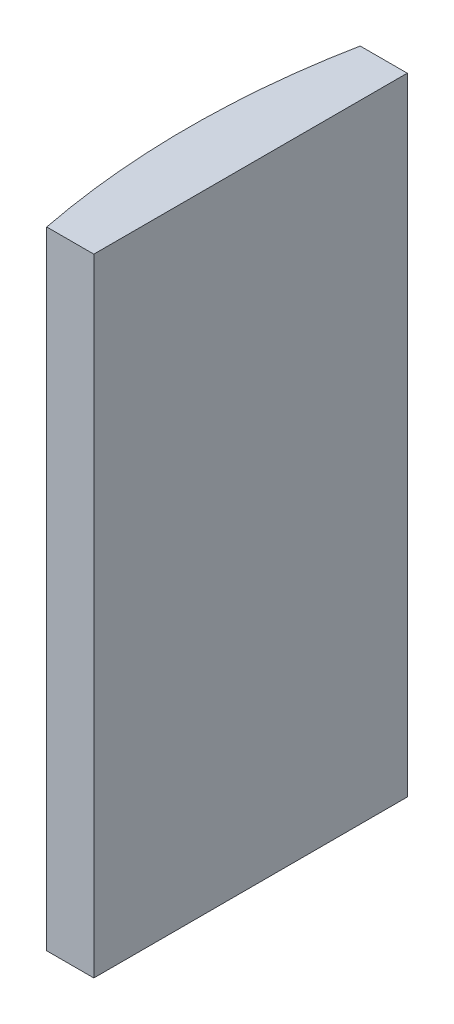
ISO-10303-21;
HEADER;
FILE_DESCRIPTION(('STEP AP214'),'2;1');
FILE_NAME('part.step','',(''),(''),'','','');
FILE_SCHEMA(('AUTOMOTIVE_DESIGN { 1 0 10303 214 1 1 1 1 }'));
ENDSEC;
DATA;
#1=APPLICATION_CONTEXT('core data for automotive mechanical design processes');
#2=APPLICATION_PROTOCOL_DEFINITION('international standard','automotive_design',2000,#1);
#3=PRODUCT_CONTEXT('',#1,'mechanical');
#4=PRODUCT('Part','Part','',(#3));
#5=PRODUCT_RELATED_PRODUCT_CATEGORY('part','',(#4));
#6=PRODUCT_DEFINITION_FORMATION('','',#4);
#7=PRODUCT_DEFINITION_CONTEXT('part definition',#1,'design');
#8=PRODUCT_DEFINITION('design','',#6,#7);
#9=PRODUCT_DEFINITION_SHAPE('','',#8);
#10=(LENGTH_UNIT() NAMED_UNIT(*) SI_UNIT(.MILLI.,.METRE.));
#11=(NAMED_UNIT(*) PLANE_ANGLE_UNIT() SI_UNIT($,.RADIAN.));
#12=(NAMED_UNIT(*) SI_UNIT($,.STERADIAN.) SOLID_ANGLE_UNIT());
#13=UNCERTAINTY_MEASURE_WITH_UNIT(LENGTH_MEASURE(1.E-05),#10,'distance_accuracy_value','');
#14=(GEOMETRIC_REPRESENTATION_CONTEXT(3) GLOBAL_UNCERTAINTY_ASSIGNED_CONTEXT((#13)) GLOBAL_UNIT_ASSIGNED_CONTEXT((#10,
#11,#12)) REPRESENTATION_CONTEXT('',''));
#15=CARTESIAN_POINT('',(0.,0.,0.));
#16=DIRECTION('',(0.,0.,1.));
#17=DIRECTION('',(1.,0.,0.));
#18=AXIS2_PLACEMENT_3D('',#15,#16,#17);
#19=CARTESIAN_POINT('',(4.35520433485127,40.,0.));
#20=DIRECTION('',(0.,-1.,0.));
#21=DIRECTION('',(0.,0.,-1.));
#22=AXIS2_PLACEMENT_3D('',#19,#20,#21);
#23=CYLINDRICAL_SURFACE('',#22,51.68);
#24=CARTESIAN_POINT('',(4.35520433485127,0.,0.));
#25=DIRECTION('',(0.,1.,0.));
#26=DIRECTION('',(0.,0.,1.));
#27=AXIS2_PLACEMENT_3D('',#24,#25,#26);
#28=CIRCLE('',#27,51.68);
#29=CARTESIAN_POINT('',(-46.3480736656883,0.,-10.));
#30=VERTEX_POINT('',#29);
#31=CARTESIAN_POINT('',(-46.3480736656883,0.,10.));
#32=VERTEX_POINT('',#31);
#33=EDGE_CURVE('E100',#30,#32,#28,.T.);
#34=ORIENTED_EDGE('',*,*,#33,.T.);
#35=DIRECTION('',(0.,-1.,0.));
#36=VECTOR('',#35,1.);
#37=CARTESIAN_POINT('',(-46.3480736656883,40.,10.));
#38=LINE('',#37,#36);
#39=CARTESIAN_POINT('',(-46.3480736656883,40.,10.));
#40=VERTEX_POINT('',#39);
#41=EDGE_CURVE('E11',#40,#32,#38,.T.);
#42=ORIENTED_EDGE('',*,*,#41,.F.);
#43=CARTESIAN_POINT('',(4.35520433485127,40.,0.));
#44=DIRECTION('',(0.,1.,0.));
#45=DIRECTION('',(0.,0.,1.));
#46=AXIS2_PLACEMENT_3D('',#43,#44,#45);
#47=CIRCLE('',#46,51.68);
#48=CARTESIAN_POINT('',(-46.3480736656883,40.,-10.));
#49=VERTEX_POINT('',#48);
#50=EDGE_CURVE('E88',#49,#40,#47,.T.);
#51=ORIENTED_EDGE('',*,*,#50,.F.);
#52=DIRECTION('',(0.,-1.,0.));
#53=VECTOR('',#52,1.);
#54=CARTESIAN_POINT('',(-46.3480736656883,40.,-10.));
#55=LINE('',#54,#53);
#56=EDGE_CURVE('E96',#49,#30,#55,.T.);
#57=ORIENTED_EDGE('',*,*,#56,.T.);
#58=EDGE_LOOP('',(#34,#42,#51,#57));
#59=FACE_BOUND('',#58,.T.);
#60=ADVANCED_FACE('F37',(#59),#23,.T.);
#61=CARTESIAN_POINT('',(-46.3480736656883,40.,10.));
#62=DIRECTION('',(0.,0.,-1.));
#63=DIRECTION('',(-1.,0.,0.));
#64=AXIS2_PLACEMENT_3D('',#61,#62,#63);
#65=PLANE('',#64);
#66=DIRECTION('',(1.,0.,0.));
#67=VECTOR('',#66,1.);
#68=CARTESIAN_POINT('',(-46.3480736656883,0.,10.));
#69=LINE('',#68,#67);
#70=CARTESIAN_POINT('',(-43.3447956651487,0.,10.));
#71=VERTEX_POINT('',#70);
#72=EDGE_CURVE('E92',#32,#71,#69,.T.);
#73=ORIENTED_EDGE('',*,*,#72,.T.);
#74=DIRECTION('',(0.,-1.,0.));
#75=VECTOR('',#74,1.);
#76=CARTESIAN_POINT('',(-43.3447956651487,40.,10.));
#77=LINE('',#76,#75);
#78=CARTESIAN_POINT('',(-43.3447956651487,40.,10.));
#79=VERTEX_POINT('',#78);
#80=EDGE_CURVE('E45',#79,#71,#77,.T.);
#81=ORIENTED_EDGE('',*,*,#80,.F.);
#82=DIRECTION('',(1.,0.,0.));
#83=VECTOR('',#82,1.);
#84=CARTESIAN_POINT('',(-46.3480736656883,40.,10.));
#85=LINE('',#84,#83);
#86=EDGE_CURVE('E83',#40,#79,#85,.T.);
#87=ORIENTED_EDGE('',*,*,#86,.F.);
#88=ORIENTED_EDGE('',*,*,#41,.T.);
#89=EDGE_LOOP('',(#73,#81,#87,#88));
#90=FACE_BOUND('',#89,.T.);
#91=ADVANCED_FACE('F91',(#90),#65,.F.);
#92=CARTESIAN_POINT('',(-43.3447956651487,40.,-9.99999999999999));
#93=DIRECTION('',(-1.,0.,0.));
#94=DIRECTION('',(0.,0.,1.));
#95=AXIS2_PLACEMENT_3D('',#92,#93,#94);
#96=PLANE('',#95);
#97=DIRECTION('',(0.,0.,-1.));
#98=VECTOR('',#97,1.);
#99=CARTESIAN_POINT('',(-43.3447956651487,0.,-9.99999999999999));
#100=LINE('',#99,#98);
#101=CARTESIAN_POINT('',(-43.3447956651487,0.,-9.99999999999999));
#102=VERTEX_POINT('',#101);
#103=EDGE_CURVE('E70',#71,#102,#100,.T.);
#104=ORIENTED_EDGE('',*,*,#103,.T.);
#105=DIRECTION('',(0.,-1.,0.));
#106=VECTOR('',#105,1.);
#107=CARTESIAN_POINT('',(-43.3447956651487,40.,-9.99999999999999));
#108=LINE('',#107,#106);
#109=CARTESIAN_POINT('',(-43.3447956651487,40.,-9.99999999999999));
#110=VERTEX_POINT('',#109);
#111=EDGE_CURVE('E93',#110,#102,#108,.T.);
#112=ORIENTED_EDGE('',*,*,#111,.F.);
#113=DIRECTION('',(0.,0.,-1.));
#114=VECTOR('',#113,1.);
#115=CARTESIAN_POINT('',(-43.3447956651487,40.,-9.99999999999999));
#116=LINE('',#115,#114);
#117=EDGE_CURVE('E86',#79,#110,#116,.T.);
#118=ORIENTED_EDGE('',*,*,#117,.F.);
#119=ORIENTED_EDGE('',*,*,#80,.T.);
#120=EDGE_LOOP('',(#104,#112,#118,#119));
#121=FACE_BOUND('',#120,.T.);
#122=ADVANCED_FACE('F94',(#121),#96,.F.);
#123=CARTESIAN_POINT('',(-46.3480736656883,40.,-10.));
#124=DIRECTION('',(0.,0.,1.));
#125=DIRECTION('',(1.,0.,0.));
#126=AXIS2_PLACEMENT_3D('',#123,#124,#125);
#127=PLANE('',#126);
#128=DIRECTION('',(-1.,0.,0.));
#129=VECTOR('',#128,1.);
#130=CARTESIAN_POINT('',(-46.3480736656883,0.,-10.));
#131=LINE('',#130,#129);
#132=EDGE_CURVE('E76',#102,#30,#131,.T.);
#133=ORIENTED_EDGE('',*,*,#132,.T.);
#134=ORIENTED_EDGE('',*,*,#56,.F.);
#135=DIRECTION('',(-1.,0.,0.));
#136=VECTOR('',#135,1.);
#137=CARTESIAN_POINT('',(-46.3480736656883,40.,-10.));
#138=LINE('',#137,#136);
#139=EDGE_CURVE('E53',#110,#49,#138,.T.);
#140=ORIENTED_EDGE('',*,*,#139,.F.);
#141=ORIENTED_EDGE('',*,*,#111,.T.);
#142=EDGE_LOOP('',(#133,#134,#140,#141));
#143=FACE_BOUND('',#142,.T.);
#144=ADVANCED_FACE('F107',(#143),#127,.F.);
#145=CARTESIAN_POINT('',(4.35520433485127,40.,0.));
#146=DIRECTION('',(0.,1.,0.));
#147=DIRECTION('',(0.,0.,1.));
#148=AXIS2_PLACEMENT_3D('',#145,#146,#147);
#149=PLANE('',#148);
#150=ORIENTED_EDGE('',*,*,#50,.T.);
#151=ORIENTED_EDGE('',*,*,#86,.T.);
#152=ORIENTED_EDGE('',*,*,#117,.T.);
#153=ORIENTED_EDGE('',*,*,#139,.T.);
#154=EDGE_LOOP('',(#150,#151,#152,#153));
#155=FACE_BOUND('',#154,.T.);
#156=ADVANCED_FACE('F84',(#155),#149,.T.);
#157=CARTESIAN_POINT('',(4.35520433485127,0.,0.));
#158=DIRECTION('',(0.,1.,0.));
#159=DIRECTION('',(0.,0.,1.));
#160=AXIS2_PLACEMENT_3D('',#157,#158,#159);
#161=PLANE('',#160);
#162=ORIENTED_EDGE('',*,*,#33,.F.);
#163=ORIENTED_EDGE('',*,*,#132,.F.);
#164=ORIENTED_EDGE('',*,*,#103,.F.);
#165=ORIENTED_EDGE('',*,*,#72,.F.);
#166=EDGE_LOOP('',(#162,#163,#164,#165));
#167=FACE_BOUND('',#166,.T.);
#168=ADVANCED_FACE('F110',(#167),#161,.F.);
#169=CLOSED_SHELL('',(#60,#91,#122,#144,#156,#168));
#170=MANIFOLD_SOLID_BREP('B2',#169);
#171=ADVANCED_BREP_SHAPE_REPRESENTATION('',(#18,#170),#14);
#172=SHAPE_DEFINITION_REPRESENTATION(#9,#171);
ENDSEC;
END-ISO-10303-21;
